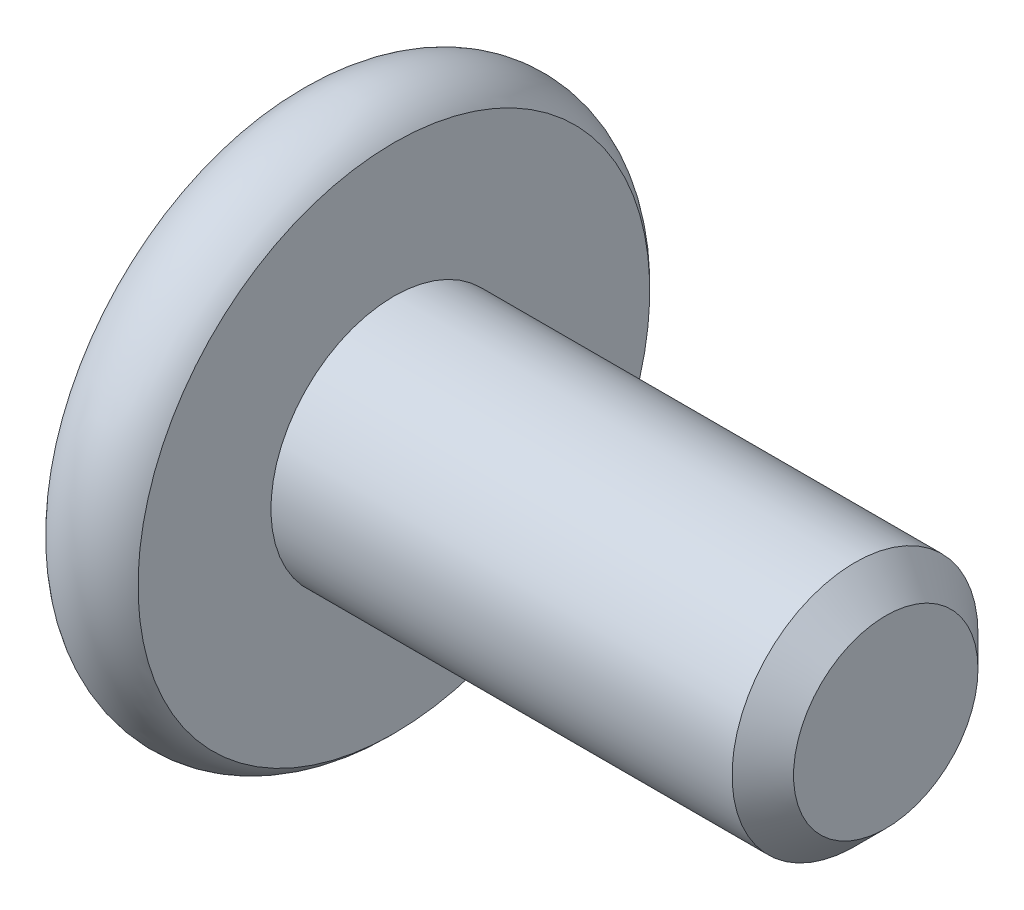
ISO-10303-21;
HEADER;
FILE_DESCRIPTION(('STEP AP214'),'2;1');
FILE_NAME('part.step','',(''),(''),'','','');
FILE_SCHEMA(('AUTOMOTIVE_DESIGN { 1 0 10303 214 1 1 1 1 }'));
ENDSEC;
DATA;
#1=APPLICATION_CONTEXT('core data for automotive mechanical design processes');
#2=APPLICATION_PROTOCOL_DEFINITION('international standard','automotive_design',2000,#1);
#3=PRODUCT_CONTEXT('',#1,'mechanical');
#4=PRODUCT('Part','Part','',(#3));
#5=PRODUCT_RELATED_PRODUCT_CATEGORY('part','',(#4));
#6=PRODUCT_DEFINITION_FORMATION('','',#4);
#7=PRODUCT_DEFINITION_CONTEXT('part definition',#1,'design');
#8=PRODUCT_DEFINITION('design','',#6,#7);
#9=PRODUCT_DEFINITION_SHAPE('','',#8);
#10=(LENGTH_UNIT() NAMED_UNIT(*) SI_UNIT(.MILLI.,.METRE.));
#11=(NAMED_UNIT(*) PLANE_ANGLE_UNIT() SI_UNIT($,.RADIAN.));
#12=(NAMED_UNIT(*) SI_UNIT($,.STERADIAN.) SOLID_ANGLE_UNIT());
#13=UNCERTAINTY_MEASURE_WITH_UNIT(LENGTH_MEASURE(1.E-05),#10,'distance_accuracy_value','');
#14=(GEOMETRIC_REPRESENTATION_CONTEXT(3) GLOBAL_UNCERTAINTY_ASSIGNED_CONTEXT((#13)) GLOBAL_UNIT_ASSIGNED_CONTEXT((#10,
#11,#12)) REPRESENTATION_CONTEXT('',''));
#15=CARTESIAN_POINT('',(0.,0.,0.));
#16=DIRECTION('',(0.,0.,1.));
#17=DIRECTION('',(1.,0.,0.));
#18=AXIS2_PLACEMENT_3D('',#15,#16,#17);
#19=CARTESIAN_POINT('',(-8.,0.,0.));
#20=DIRECTION('',(1.,0.,0.));
#21=DIRECTION('',(0.,0.,-1.));
#22=AXIS2_PLACEMENT_3D('',#19,#20,#21);
#23=CYLINDRICAL_SURFACE('',#22,2.);
#24=CARTESIAN_POINT('',(-0.500000000000002,0.,0.));
#25=DIRECTION('',(1.,0.,0.));
#26=DIRECTION('',(0.,0.,-1.));
#27=AXIS2_PLACEMENT_3D('',#24,#25,#26);
#28=CIRCLE('',#27,2.);
#29=CARTESIAN_POINT('',(-0.500000000000002,0.,-2.));
#30=VERTEX_POINT('',#29);
#31=EDGE_CURVE('E49',#30,#30,#28,.F.);
#32=ORIENTED_EDGE('',*,*,#31,.T.);
#33=EDGE_LOOP('',(#32));
#34=FACE_BOUND('',#33,.T.);
#35=CARTESIAN_POINT('',(-8.,0.,0.));
#36=DIRECTION('',(1.,0.,0.));
#37=DIRECTION('',(0.,1.,0.));
#38=AXIS2_PLACEMENT_3D('',#35,#36,#37);
#39=CIRCLE('',#38,2.);
#40=CARTESIAN_POINT('',(-8.,1.99999999999999,0.));
#41=VERTEX_POINT('',#40);
#42=EDGE_CURVE('E134',#41,#41,#39,.F.);
#43=ORIENTED_EDGE('',*,*,#42,.F.);
#44=EDGE_LOOP('',(#43));
#45=FACE_BOUND('',#44,.T.);
#46=ADVANCED_FACE('F35',(#34,#45),#23,.T.);
#47=CARTESIAN_POINT('',(0.,0.,0.));
#48=DIRECTION('',(1.,0.,0.));
#49=DIRECTION('',(0.,0.,-1.));
#50=AXIS2_PLACEMENT_3D('',#47,#48,#49);
#51=PLANE('',#50);
#52=CARTESIAN_POINT('',(0.,0.,0.));
#53=DIRECTION('',(1.,0.,0.));
#54=DIRECTION('',(0.,0.,-1.));
#55=AXIS2_PLACEMENT_3D('',#52,#53,#54);
#56=CIRCLE('',#55,1.5);
#57=CARTESIAN_POINT('',(0.,0.,-1.5));
#58=VERTEX_POINT('',#57);
#59=EDGE_CURVE('E138',#58,#58,#56,.T.);
#60=ORIENTED_EDGE('',*,*,#59,.T.);
#61=EDGE_LOOP('',(#60));
#62=FACE_BOUND('',#61,.T.);
#63=ADVANCED_FACE('F152',(#62),#51,.T.);
#64=CARTESIAN_POINT('',(0.,0.,0.));
#65=DIRECTION('',(-1.,0.,0.));
#66=DIRECTION('',(0.,0.,1.));
#67=AXIS2_PLACEMENT_3D('',#64,#65,#66);
#68=CONICAL_SURFACE('',#67,1.5,0.785398163397445);
#69=ORIENTED_EDGE('',*,*,#31,.F.);
#70=EDGE_LOOP('',(#69));
#71=FACE_BOUND('',#70,.T.);
#72=ORIENTED_EDGE('',*,*,#59,.F.);
#73=EDGE_LOOP('',(#72));
#74=FACE_BOUND('',#73,.T.);
#75=ADVANCED_FACE('F37',(#71,#74),#68,.T.);
#76=CARTESIAN_POINT('',(-9.5,0.,0.));
#77=DIRECTION('',(-1.,0.,0.));
#78=DIRECTION('',(0.,-1.,0.));
#79=AXIS2_PLACEMENT_3D('',#76,#77,#78);
#80=PLANE('',#79);
#81=CARTESIAN_POINT('',(-9.5,0.,0.));
#82=DIRECTION('',(-1.,0.,0.));
#83=DIRECTION('',(0.,-1.,0.));
#84=AXIS2_PLACEMENT_3D('',#81,#82,#83);
#85=CIRCLE('',#84,1.78205080756887);
#86=CARTESIAN_POINT('',(-9.50000000000001,-1.78205080756883,0.));
#87=VERTEX_POINT('',#86);
#88=EDGE_CURVE('E376',#87,#87,#85,.T.);
#89=ORIENTED_EDGE('',*,*,#88,.F.);
#90=EDGE_LOOP('',(#89));
#91=FACE_BOUND('',#90,.T.);
#92=CARTESIAN_POINT('',(-9.5,0.,0.));
#93=DIRECTION('',(1.,0.,0.));
#94=DIRECTION('',(0.,1.,0.));
#95=AXIS2_PLACEMENT_3D('',#92,#93,#94);
#96=CIRCLE('',#95,4.16143782776615);
#97=CARTESIAN_POINT('',(-9.5,4.16143782776615,0.));
#98=VERTEX_POINT('',#97);
#99=EDGE_CURVE('E130',#98,#98,#96,.T.);
#100=ORIENTED_EDGE('',*,*,#99,.F.);
#101=EDGE_LOOP('',(#100));
#102=FACE_BOUND('',#101,.T.);
#103=ADVANCED_FACE('F151',(#91,#102),#80,.T.);
#104=CARTESIAN_POINT('',(-8.75,0.,0.));
#105=DIRECTION('',(1.,0.,0.));
#106=DIRECTION('',(0.,1.,0.));
#107=AXIS2_PLACEMENT_3D('',#104,#105,#106);
#108=TOROIDAL_SURFACE('',#107,3.5,1.);
#109=ORIENTED_EDGE('',*,*,#99,.T.);
#110=EDGE_LOOP('',(#109));
#111=FACE_BOUND('',#110,.T.);
#112=CARTESIAN_POINT('',(-8.,0.,0.));
#113=DIRECTION('',(1.,0.,0.));
#114=DIRECTION('',(0.,1.,0.));
#115=AXIS2_PLACEMENT_3D('',#112,#113,#114);
#116=CIRCLE('',#115,4.16143782776615);
#117=CARTESIAN_POINT('',(-8.,4.16143782776615,0.));
#118=VERTEX_POINT('',#117);
#119=EDGE_CURVE('E126',#118,#118,#116,.T.);
#120=ORIENTED_EDGE('',*,*,#119,.F.);
#121=EDGE_LOOP('',(#120));
#122=FACE_BOUND('',#121,.T.);
#123=ADVANCED_FACE('F163',(#111,#122),#108,.T.);
#124=CARTESIAN_POINT('',(-8.,4.16143782776615,0.));
#125=DIRECTION('',(1.,0.,0.));
#126=DIRECTION('',(0.,1.,0.));
#127=AXIS2_PLACEMENT_3D('',#124,#125,#126);
#128=PLANE('',#127);
#129=ORIENTED_EDGE('',*,*,#42,.T.);
#130=EDGE_LOOP('',(#129));
#131=FACE_BOUND('',#130,.T.);
#132=ORIENTED_EDGE('',*,*,#119,.T.);
#133=EDGE_LOOP('',(#132));
#134=FACE_BOUND('',#133,.T.);
#135=ADVANCED_FACE('F167',(#131,#134),#128,.T.);
#136=CARTESIAN_POINT('',(-9.5,0.,0.));
#137=DIRECTION('',(-1.,0.,0.));
#138=DIRECTION('',(0.,-1.,0.));
#139=AXIS2_PLACEMENT_3D('',#136,#137,#138);
#140=CONICAL_SURFACE('',#139,1.78205080756887,0.78539816339745);
#141=ORIENTED_EDGE('',*,*,#88,.T.);
#142=EDGE_LOOP('',(#141));
#143=FACE_BOUND('',#142,.T.);
#144=CARTESIAN_POINT('',(-10.015428085613,-1.74023253176578,1.5));
#145=CARTESIAN_POINT('',(-9.98338110734452,-1.69791724929732,1.5));
#146=CARTESIAN_POINT('',(-9.95164446728407,-1.65536760966793,1.5));
#147=CARTESIAN_POINT('',(-9.8889203936153,-1.56970398156686,1.5));
#148=CARTESIAN_POINT('',(-9.85793314821998,-1.5265898554285,1.5));
#149=CARTESIAN_POINT('',(-9.76584616434498,-1.39562626326564,1.5));
#150=CARTESIAN_POINT('',(-9.70611451230213,-1.30679868010577,1.5));
#151=CARTESIAN_POINT('',(-9.58873428910124,-1.12044622640216,1.5));
#152=CARTESIAN_POINT('',(-9.53140827748225,-1.02271587306674,1.5));
#153=CARTESIAN_POINT('',(-9.42646321497596,-0.822357214965266,1.5));
#154=CARTESIAN_POINT('',(-9.37881142368962,-0.719746931701929,1.5));
#155=CARTESIAN_POINT('',(-9.32050998831504,-0.565852387095102,1.5));
#156=CARTESIAN_POINT('',(-9.30379905354091,-0.51687419142469,1.5));
#157=CARTESIAN_POINT('',(-9.2743077515089,-0.417723988457529,1.5));
#158=CARTESIAN_POINT('',(-9.26152765142192,-0.367551900263895,1.5));
#159=CARTESIAN_POINT('',(-9.24077842024577,-0.267158299056145,1.5));
#160=CARTESIAN_POINT('',(-9.23272606182594,-0.216954261864881,1.5));
#161=CARTESIAN_POINT('',(-9.22159163683403,-0.115994915871347,1.5));
#162=CARTESIAN_POINT('',(-9.21850868863769,-0.0652397064615641,1.5));
#163=CARTESIAN_POINT('',(-9.21754738974038,0.0344222234875319,1.5));
#164=CARTESIAN_POINT('',(-9.21947892169515,0.0833271701100658,1.5));
#165=CARTESIAN_POINT('',(-9.22801757296766,0.180724293127199,1.5));
#166=CARTESIAN_POINT('',(-9.23462514204803,0.229216429361706,1.5));
#167=CARTESIAN_POINT('',(-9.25226506264469,0.326258027696986,1.5));
#168=CARTESIAN_POINT('',(-9.26337316820097,0.374793507450007,1.5));
#169=CARTESIAN_POINT('',(-9.28941986695952,0.470802295834161,1.5));
#170=CARTESIAN_POINT('',(-9.3043581560035,0.518275688481264,1.5));
#171=CARTESIAN_POINT('',(-9.35683954571596,0.667150562065113,1.5));
#172=CARTESIAN_POINT('',(-9.40033511654417,0.766448362426832,1.5));
#173=CARTESIAN_POINT('',(-9.49705878148361,0.960384405673818,1.5));
#174=CARTESIAN_POINT('',(-9.55032172266746,1.05500437383619,1.5));
#175=CARTESIAN_POINT('',(-9.66022580104534,1.2358452032153,1.5));
#176=CARTESIAN_POINT('',(-9.7165682531046,1.32224986946548,1.5));
#177=CARTESIAN_POINT('',(-9.80367557259701,1.44954953726472,1.5));
#178=CARTESIAN_POINT('',(-9.83301999068387,1.49143368482421,1.5));
#179=CARTESIAN_POINT('',(-9.89248691829305,1.57462914783243,1.5));
#180=CARTESIAN_POINT('',(-9.92260921150072,1.61594061772578,1.5));
#181=CARTESIAN_POINT('',(-9.95305411813655,1.65701358742551,1.5));
#182=B_SPLINE_CURVE_WITH_KNOTS('',3,(#144,#145,#146,#147,#148,#149,#150,#151,#152,#153,#154,
#155,#156,#157,#158,#159,#160,#161,#162,#163,#164,#165,#166,#167,#168,#169,#170,#171,#172,#173,
#174,#175,#176,#177,#178,#179,#180,#181),.UNSPECIFIED.,.F.,.F.,(4,2,2,2,2,2,2,2,2,2,2,2,2,2,2,2,
2,2,4),(0.,0.159238974218354,0.318517535014543,0.639504781932389,0.9791378937992,
1.31760168934357,1.47272233841624,1.62785352839776,1.78016486537347,1.93244917778279,
2.07904486260298,2.22565464958333,2.37484213303399,2.5240177730404,2.84828365283776,
3.1737297566675,3.48303030530537,3.63644667013909,3.78982082222913),.UNSPECIFIED.);
#183=CARTESIAN_POINT('',(-9.45000000000002,-0.866025403784403,1.5));
#184=VERTEX_POINT('',#183);
#185=CARTESIAN_POINT('',(-9.45000000000001,0.866025403784475,1.5));
#186=VERTEX_POINT('',#185);
#187=EDGE_CURVE('E104',#184,#186,#182,.T.);
#188=ORIENTED_EDGE('',*,*,#187,.F.);
#189=CARTESIAN_POINT('',(-9.45011548160009,-1.73216627762268,-0.0002000000000008));
#190=CARTESIAN_POINT('',(-9.42036547606735,-1.70239359975911,0.0513677907370748));
#191=CARTESIAN_POINT('',(-9.39236248391033,-1.67212305186351,0.1037979176652));
#192=CARTESIAN_POINT('',(-9.34108923044016,-1.61039789003616,0.210709034055596));
#193=CARTESIAN_POINT('',(-9.31784750504439,-1.57893740312611,0.265200195814661));
#194=CARTESIAN_POINT('',(-9.27803372899224,-1.51549879897984,0.375079081357248));
#195=CARTESIAN_POINT('',(-9.26136158567092,-1.48353684526807,0.430438809095199));
#196=CARTESIAN_POINT('',(-9.23567445681812,-1.41890915196208,0.54237725747715));
#197=CARTESIAN_POINT('',(-9.22664029047888,-1.38624538781115,0.598952556553008));
#198=CARTESIAN_POINT('',(-9.21848908122687,-1.32995210095296,0.696455389516441));
#199=CARTESIAN_POINT('',(-9.21728225298923,-1.3063953331112,0.737256908280466));
#200=CARTESIAN_POINT('',(-9.21931405716228,-1.2593233529019,0.818787969615858));
#201=CARTESIAN_POINT('',(-9.22255367074832,-1.2358081508531,0.85951749431463));
#202=CARTESIAN_POINT('',(-9.23329198598198,-1.18900414978423,0.940584402163416));
#203=CARTESIAN_POINT('',(-9.24079465301875,-1.16571558211716,0.980921384598288));
#204=CARTESIAN_POINT('',(-9.25965161192831,-1.11952932016332,1.06091833691403));
#205=CARTESIAN_POINT('',(-9.2710075570186,-1.09663179808783,1.10057800851621));
#206=CARTESIAN_POINT('',(-9.30472164759269,-1.03798159809695,1.20216313477448));
#207=CARTESIAN_POINT('',(-9.32962184909338,-1.00259267147462,1.26345855370969));
#208=CARTESIAN_POINT('',(-9.37165665327159,-0.950557780604339,1.35358562846331));
#209=CARTESIAN_POINT('',(-9.38642515355911,-0.933410759677112,1.38328513990772));
#210=CARTESIAN_POINT('',(-9.41731056594019,-0.899432101996371,1.44213790138375));
#211=CARTESIAN_POINT('',(-9.43342683412173,-0.882600319285675,1.47129140422064));
#212=CARTESIAN_POINT('',(-9.45011548160009,-0.865909933730565,1.5002));
#213=B_SPLINE_CURVE_WITH_KNOTS('',3,(#189,#190,#191,#192,#193,#194,#195,#196,#197,#198,#199,
#200,#201,#202,#203,#204,#205,#206,#207,#208,#209,#210,#211,#212),.UNSPECIFIED.,.F.,.F.,(4,2,2,
2,2,2,2,2,2,2,2,4),(0.,0.199829143693305,0.400822987382389,0.598623720538181,0.795926240188889,
0.937113067959881,1.07833105577193,1.21968061668222,1.36109089931054,1.58570969637565,
1.69770705470964,1.80965120737194),.UNSPECIFIED.);
#214=CARTESIAN_POINT('',(-9.45000000000002,-1.73205080756884,0.));
#215=VERTEX_POINT('',#214);
#216=EDGE_CURVE('E209',#215,#184,#213,.T.);
#217=ORIENTED_EDGE('',*,*,#216,.F.);
#218=CARTESIAN_POINT('',(-9.45011548160009,-0.865909933730564,-1.5002));
#219=CARTESIAN_POINT('',(-9.42036547606734,-0.895682611594129,-1.44863220926292));
#220=CARTESIAN_POINT('',(-9.39236248391033,-0.925953159489729,-1.3962020823348));
#221=CARTESIAN_POINT('',(-9.34108923044016,-0.987678321317088,-1.2892909659444));
#222=CARTESIAN_POINT('',(-9.31784750504439,-1.01913880822714,-1.23479980418534));
#223=CARTESIAN_POINT('',(-9.27803372899224,-1.08257741237341,-1.12492091864275));
#224=CARTESIAN_POINT('',(-9.26136158567091,-1.11453936608518,-1.0695611909048));
#225=CARTESIAN_POINT('',(-9.23567445681812,-1.17916705939117,-0.95762274252285));
#226=CARTESIAN_POINT('',(-9.22664029047888,-1.2118308235421,-0.901047443446992));
#227=CARTESIAN_POINT('',(-9.21848908122687,-1.26812411040029,-0.80354461048356));
#228=CARTESIAN_POINT('',(-9.21728225298923,-1.29168087824204,-0.762743091719535));
#229=CARTESIAN_POINT('',(-9.21931405716228,-1.33875285845135,-0.681212030384143));
#230=CARTESIAN_POINT('',(-9.22255367074832,-1.36226806050015,-0.640482505685371));
#231=CARTESIAN_POINT('',(-9.23329198598198,-1.40907206156901,-0.559415597836585));
#232=CARTESIAN_POINT('',(-9.24079465301875,-1.43236062923608,-0.519078615401713));
#233=CARTESIAN_POINT('',(-9.25965161192831,-1.47854689118993,-0.43908166308597));
#234=CARTESIAN_POINT('',(-9.2710075570186,-1.50144441326542,-0.399421991483793));
#235=CARTESIAN_POINT('',(-9.30472164759269,-1.5600946132563,-0.297836865225517));
#236=CARTESIAN_POINT('',(-9.32962184909339,-1.59548353987863,-0.236541446290313));
#237=CARTESIAN_POINT('',(-9.37165665327159,-1.6475184307489,-0.146414371536688));
#238=CARTESIAN_POINT('',(-9.38642515355911,-1.66466545167613,-0.116714860092284));
#239=CARTESIAN_POINT('',(-9.41731056594019,-1.69864410935687,-0.0578620986162505));
#240=CARTESIAN_POINT('',(-9.43342683412173,-1.71547589206757,-0.0287085957793642));
#241=CARTESIAN_POINT('',(-9.45011548160009,-1.73216627762268,0.000199999999998753));
#242=B_SPLINE_CURVE_WITH_KNOTS('',3,(#218,#219,#220,#221,#222,#223,#224,#225,#226,#227,#228,
#229,#230,#231,#232,#233,#234,#235,#236,#237,#238,#239,#240,#241),.UNSPECIFIED.,.F.,.F.,(4,2,2,
2,2,2,2,2,2,2,2,4),(0.,0.199829143693305,0.400822987382389,0.59862372053818,0.795926240188888,
0.93711306795988,1.07833105577193,1.21968061668222,1.36109089931054,1.58570969637565,
1.69770705470963,1.80965120737194),.UNSPECIFIED.);
#243=CARTESIAN_POINT('',(-9.45000000000002,-0.866025403784402,-1.5));
#244=VERTEX_POINT('',#243);
#245=EDGE_CURVE('E204',#244,#215,#242,.T.);
#246=ORIENTED_EDGE('',*,*,#245,.F.);
#247=CARTESIAN_POINT('',(-10.0154280857208,-1.74023253190811,-1.5));
#248=CARTESIAN_POINT('',(-9.98338110744817,-1.69791724943563,-1.5));
#249=CARTESIAN_POINT('',(-9.95164446738357,-1.65536760980222,-1.5));
#250=CARTESIAN_POINT('',(-9.88892039370652,-1.56970398169306,-1.5));
#251=CARTESIAN_POINT('',(-9.85793314830708,-1.52658985555063,-1.5));
#252=CARTESIAN_POINT('',(-9.76584616441963,-1.39562626337533,-1.5));
#253=CARTESIAN_POINT('',(-9.70611451236851,-1.30679868020699,-1.5));
#254=CARTESIAN_POINT('',(-9.58873428915059,-1.12044622648493,-1.5));
#255=CARTESIAN_POINT('',(-9.53140827752292,-1.02271587313946,-1.5));
#256=CARTESIAN_POINT('',(-9.42646321500052,-0.822357215017053,-1.5));
#257=CARTESIAN_POINT('',(-9.37881142370675,-0.719746931742828,-1.5));
#258=CARTESIAN_POINT('',(-9.32050998832669,-0.565852387127819,-1.5));
#259=CARTESIAN_POINT('',(-9.30379905355281,-0.516874191460854,-1.5));
#260=CARTESIAN_POINT('',(-9.2743077515206,-0.417723988500702,-1.5));
#261=CARTESIAN_POINT('',(-9.26152765143317,-0.367551900310631,-1.5));
#262=CARTESIAN_POINT('',(-9.24077842025532,-0.267158299109891,-1.5));
#263=CARTESIAN_POINT('',(-9.23272606183424,-0.216954261922072,-1.5));
#264=CARTESIAN_POINT('',(-9.22159163683908,-0.115994915935317,-1.5));
#265=CARTESIAN_POINT('',(-9.21850868864073,-0.0652397065288679,-1.5));
#266=CARTESIAN_POINT('',(-9.21754738973879,0.0344222234141592,-1.5));
#267=CARTESIAN_POINT('',(-9.21947892169101,0.0833271700339495,-1.5));
#268=CARTESIAN_POINT('',(-9.22801757295801,0.180724293045874,-1.5));
#269=CARTESIAN_POINT('',(-9.23462514203542,0.229216429277917,-1.5));
#270=CARTESIAN_POINT('',(-9.2522650626259,0.326258027608332,-1.5));
#271=CARTESIAN_POINT('',(-9.26337316817893,0.37479350735896,-1.5));
#272=CARTESIAN_POINT('',(-9.28941986693092,0.470802295738563,-1.5));
#273=CARTESIAN_POINT('',(-9.30435815597158,0.518275688383507,-1.5));
#274=CARTESIAN_POINT('',(-9.35683954566847,0.66715056194616,-1.5));
#275=CARTESIAN_POINT('',(-9.40033511648235,0.766448362289903,-1.5));
#276=CARTESIAN_POINT('',(-9.49705878139157,0.960384405502318,-1.5));
#277=CARTESIAN_POINT('',(-9.5503217225595,1.0550043736481,-1.5));
#278=CARTESIAN_POINT('',(-9.66022580090691,1.2358452029974,-1.5));
#279=CARTESIAN_POINT('',(-9.71656825295176,1.32224986923425,-1.5));
#280=CARTESIAN_POINT('',(-9.80367557242264,1.44954953701377,-1.5));
#281=CARTESIAN_POINT('',(-9.83301999050238,1.49143368456679,-1.5));
#282=CARTESIAN_POINT('',(-9.89248691809732,1.57462914756209,-1.5));
#283=CARTESIAN_POINT('',(-9.92260921129788,1.615940617449,-1.5));
#284=CARTESIAN_POINT('',(-9.9530541179266,1.65701358714232,-1.5));
#285=B_SPLINE_CURVE_WITH_KNOTS('',3,(#247,#248,#249,#250,#251,#252,#253,#254,#255,#256,#257,
#258,#259,#260,#261,#262,#263,#264,#265,#266,#267,#268,#269,#270,#271,#272,#273,#274,#275,#276,
#277,#278,#279,#280,#281,#282,#283,#284),.UNSPECIFIED.,.F.,.F.,(4,2,2,2,2,2,2,2,2,2,2,2,2,2,2,2,
2,2,4),(0.,0.159238974235479,0.318517535048799,0.639504782001543,0.979137893907513,
1.31760168949067,1.47272233855335,1.62785352852489,1.78016486549104,1.93244917789081,
2.0790448627025,2.22565464967435,2.37484213311585,2.52401777311309,2.8482836528441,
3.17372975660706,3.48303030518781,3.63644666999335,3.78982082205522),.UNSPECIFIED.);
#286=CARTESIAN_POINT('',(-9.45000000000001,0.866025403784475,-1.5));
#287=VERTEX_POINT('',#286);
#288=EDGE_CURVE('E56',#287,#244,#285,.F.);
#289=ORIENTED_EDGE('',*,*,#288,.F.);
#290=CARTESIAN_POINT('',(-9.45011548160008,1.73216627762275,0.000200000000000434));
#291=CARTESIAN_POINT('',(-9.42036547606733,1.70239359975919,-0.0513677907370751));
#292=CARTESIAN_POINT('',(-9.39236248391032,1.67212305186359,-0.1037979176652));
#293=CARTESIAN_POINT('',(-9.34108923044015,1.61039789003623,-0.210709034055596));
#294=CARTESIAN_POINT('',(-9.31784750504438,1.57893740312618,-0.265200195814661));
#295=CARTESIAN_POINT('',(-9.27803372899223,1.51549879897991,-0.375079081357249));
#296=CARTESIAN_POINT('',(-9.2613615856709,1.48353684526814,-0.4304388090952));
#297=CARTESIAN_POINT('',(-9.23567445681811,1.41890915196215,-0.542377257477151));
#298=CARTESIAN_POINT('',(-9.22664029047887,1.38624538781122,-0.598952556553009));
#299=CARTESIAN_POINT('',(-9.21848908122686,1.32995210095303,-0.696455389516441));
#300=CARTESIAN_POINT('',(-9.21728225298922,1.30639533311127,-0.737256908280467));
#301=CARTESIAN_POINT('',(-9.21931405716228,1.25932335290197,-0.818787969615859));
#302=CARTESIAN_POINT('',(-9.22255367074832,1.23580815085317,-0.859517494314631));
#303=CARTESIAN_POINT('',(-9.23329198598197,1.1890041497843,-0.940584402163417));
#304=CARTESIAN_POINT('',(-9.24079465301874,1.16571558211723,-0.980921384598289));
#305=CARTESIAN_POINT('',(-9.2596516119283,1.11952932016339,-1.06091833691403));
#306=CARTESIAN_POINT('',(-9.27100755701859,1.0966317980879,-1.10057800851621));
#307=CARTESIAN_POINT('',(-9.30472164759268,1.03798159809702,-1.20216313477449));
#308=CARTESIAN_POINT('',(-9.32962184909338,1.00259267147469,-1.26345855370969));
#309=CARTESIAN_POINT('',(-9.37165665327159,0.950557780604411,-1.35358562846331));
#310=CARTESIAN_POINT('',(-9.38642515355911,0.933410759677184,-1.38328513990772));
#311=CARTESIAN_POINT('',(-9.41731056594018,0.899432101996443,-1.44213790138375));
#312=CARTESIAN_POINT('',(-9.43342683412172,0.882600319285746,-1.47129140422064));
#313=CARTESIAN_POINT('',(-9.45011548160008,0.865909933730638,-1.5002));
#314=B_SPLINE_CURVE_WITH_KNOTS('',3,(#290,#291,#292,#293,#294,#295,#296,#297,#298,#299,#300,
#301,#302,#303,#304,#305,#306,#307,#308,#309,#310,#311,#312,#313),.UNSPECIFIED.,.F.,.F.,(4,2,2,
2,2,2,2,2,2,2,2,4),(0.,0.199829143693305,0.40082298738239,0.598623720538181,0.79592624018889,
0.937113067959882,1.07833105577193,1.21968061668222,1.36109089931055,1.58570969637565,
1.69770705470964,1.80965120737194),.UNSPECIFIED.);
#315=CARTESIAN_POINT('',(-9.45000000000001,1.73205080756891,0.));
#316=VERTEX_POINT('',#315);
#317=EDGE_CURVE('E11',#316,#287,#314,.T.);
#318=ORIENTED_EDGE('',*,*,#317,.F.);
#319=CARTESIAN_POINT('',(-9.45011548160008,0.865909933730637,1.5002));
#320=CARTESIAN_POINT('',(-9.42036547606734,0.895682611594202,1.44863220926292));
#321=CARTESIAN_POINT('',(-9.39236248391032,0.925953159489801,1.3962020823348));
#322=CARTESIAN_POINT('',(-9.34108923044015,0.987678321317159,1.2892909659444));
#323=CARTESIAN_POINT('',(-9.31784750504438,1.01913880822721,1.23479980418534));
#324=CARTESIAN_POINT('',(-9.27803372899223,1.08257741237348,1.12492091864275));
#325=CARTESIAN_POINT('',(-9.2613615856709,1.11453936608525,1.0695611909048));
#326=CARTESIAN_POINT('',(-9.23567445681811,1.17916705939124,0.95762274252285));
#327=CARTESIAN_POINT('',(-9.22664029047887,1.21183082354217,0.901047443446993));
#328=CARTESIAN_POINT('',(-9.21848908122686,1.26812411040036,0.803544610483561));
#329=CARTESIAN_POINT('',(-9.21728225298922,1.29168087824211,0.762743091719535));
#330=CARTESIAN_POINT('',(-9.21931405716227,1.33875285845142,0.681212030384143));
#331=CARTESIAN_POINT('',(-9.22255367074831,1.36226806050022,0.640482505685372));
#332=CARTESIAN_POINT('',(-9.23329198598197,1.40907206156908,0.559415597836586));
#333=CARTESIAN_POINT('',(-9.24079465301874,1.43236062923616,0.519078615401714));
#334=CARTESIAN_POINT('',(-9.2596516119283,1.47854689119,0.439081663085971));
#335=CARTESIAN_POINT('',(-9.27100755701859,1.50144441326549,0.399421991483793));
#336=CARTESIAN_POINT('',(-9.30472164759268,1.56009461325637,0.297836865225516));
#337=CARTESIAN_POINT('',(-9.32962184909337,1.5954835398787,0.236541446290312));
#338=CARTESIAN_POINT('',(-9.37165665327158,1.64751843074898,0.146414371536687));
#339=CARTESIAN_POINT('',(-9.3864251535591,1.6646654516762,0.116714860092283));
#340=CARTESIAN_POINT('',(-9.41731056594018,1.69864410935694,0.0578620986162494));
#341=CARTESIAN_POINT('',(-9.43342683412172,1.71547589206764,0.0287085957793633));
#342=CARTESIAN_POINT('',(-9.45011548160008,1.73216627762275,-0.000199999999999442));
#343=B_SPLINE_CURVE_WITH_KNOTS('',3,(#319,#320,#321,#322,#323,#324,#325,#326,#327,#328,#329,
#330,#331,#332,#333,#334,#335,#336,#337,#338,#339,#340,#341,#342),.UNSPECIFIED.,.F.,.F.,(4,2,2,
2,2,2,2,2,2,2,2,4),(0.,0.199829143693304,0.400822987382387,0.598623720538179,0.795926240188887,
0.937113067959879,1.07833105577193,1.21968061668222,1.36109089931054,1.58570969637565,
1.69770705470963,1.80965120737194),.UNSPECIFIED.);
#344=EDGE_CURVE('E94',#186,#316,#343,.T.);
#345=ORIENTED_EDGE('',*,*,#344,.F.);
#346=EDGE_LOOP('',(#188,#217,#246,#289,#318,#345));
#347=FACE_BOUND('',#346,.T.);
#348=ADVANCED_FACE('F93',(#143,#347),#140,.F.);
#349=CARTESIAN_POINT('',(-7.2,0.,0.));
#350=DIRECTION('',(-1.,0.,0.));
#351=DIRECTION('',(0.,-1.,0.));
#352=AXIS2_PLACEMENT_3D('',#349,#350,#351);
#353=PLANE('',#352);
#354=DIRECTION('',(0.,0.5,-0.866025403784438));
#355=VECTOR('',#354,1.);
#356=CARTESIAN_POINT('',(-7.2,0.866025403784467,1.5));
#357=LINE('',#356,#355);
#358=CARTESIAN_POINT('',(-7.2,0.866025403784467,1.5));
#359=VERTEX_POINT('',#358);
#360=CARTESIAN_POINT('',(-7.19999999999999,1.7320508075689,0.));
#361=VERTEX_POINT('',#360);
#362=EDGE_CURVE('E103',#359,#361,#357,.T.);
#363=ORIENTED_EDGE('',*,*,#362,.T.);
#364=DIRECTION('',(0.,-0.5,-0.866025403784439));
#365=VECTOR('',#364,1.);
#366=CARTESIAN_POINT('',(-7.19999999999999,1.7320508075689,0.));
#367=LINE('',#366,#365);
#368=CARTESIAN_POINT('',(-7.2,0.866025403784467,-1.5));
#369=VERTEX_POINT('',#368);
#370=EDGE_CURVE('E108',#361,#369,#367,.T.);
#371=ORIENTED_EDGE('',*,*,#370,.T.);
#372=DIRECTION('',(0.,-1.,0.));
#373=VECTOR('',#372,1.);
#374=CARTESIAN_POINT('',(-7.2,0.866025403784467,-1.5));
#375=LINE('',#374,#373);
#376=CARTESIAN_POINT('',(-7.2,-0.866025403784411,-1.5));
#377=VERTEX_POINT('',#376);
#378=EDGE_CURVE('E235',#369,#377,#375,.T.);
#379=ORIENTED_EDGE('',*,*,#378,.T.);
#380=DIRECTION('',(0.,-0.5,0.866025403784439));
#381=VECTOR('',#380,1.);
#382=CARTESIAN_POINT('',(-7.2,-0.866025403784411,-1.5));
#383=LINE('',#382,#381);
#384=CARTESIAN_POINT('',(-7.20000000000001,-1.73205080756885,0.));
#385=VERTEX_POINT('',#384);
#386=EDGE_CURVE('E240',#377,#385,#383,.T.);
#387=ORIENTED_EDGE('',*,*,#386,.T.);
#388=DIRECTION('',(0.,0.5,0.866025403784439));
#389=VECTOR('',#388,1.);
#390=CARTESIAN_POINT('',(-7.20000000000001,-1.73205080756885,0.));
#391=LINE('',#390,#389);
#392=CARTESIAN_POINT('',(-7.2,-0.866025403784412,1.5));
#393=VERTEX_POINT('',#392);
#394=EDGE_CURVE('E122',#385,#393,#391,.T.);
#395=ORIENTED_EDGE('',*,*,#394,.T.);
#396=DIRECTION('',(0.,1.,0.));
#397=VECTOR('',#396,1.);
#398=CARTESIAN_POINT('',(-7.2,-0.866025403784412,1.5));
#399=LINE('',#398,#397);
#400=EDGE_CURVE('E112',#393,#359,#399,.T.);
#401=ORIENTED_EDGE('',*,*,#400,.T.);
#402=EDGE_LOOP('',(#363,#371,#379,#387,#395,#401));
#403=FACE_BOUND('',#402,.T.);
#404=ADVANCED_FACE('F191',(#403),#353,.T.);
#405=CARTESIAN_POINT('',(-7.19999999999999,1.7320508075689,0.));
#406=DIRECTION('',(0.,0.866025403784439,-0.5));
#407=DIRECTION('',(0.,0.5,0.866025403784439));
#408=AXIS2_PLACEMENT_3D('',#405,#406,#407);
#409=PLANE('',#408);
#410=DIRECTION('',(-1.,0.,0.));
#411=VECTOR('',#410,1.);
#412=CARTESIAN_POINT('',(-7.19999999999999,1.7320508075689,0.));
#413=LINE('',#412,#411);
#414=EDGE_CURVE('E100',#361,#316,#413,.T.);
#415=ORIENTED_EDGE('',*,*,#414,.T.);
#416=ORIENTED_EDGE('',*,*,#317,.T.);
#417=DIRECTION('',(-1.,0.,0.));
#418=VECTOR('',#417,1.);
#419=CARTESIAN_POINT('',(-7.2,0.866025403784467,-1.5));
#420=LINE('',#419,#418);
#421=EDGE_CURVE('E111',#369,#287,#420,.T.);
#422=ORIENTED_EDGE('',*,*,#421,.F.);
#423=ORIENTED_EDGE('',*,*,#370,.F.);
#424=EDGE_LOOP('',(#415,#416,#422,#423));
#425=FACE_BOUND('',#424,.T.);
#426=ADVANCED_FACE('F106',(#425),#409,.F.);
#427=CARTESIAN_POINT('',(-7.2,0.866025403784467,-1.5));
#428=DIRECTION('',(0.,0.,-1.));
#429=DIRECTION('',(0.,1.,0.));
#430=AXIS2_PLACEMENT_3D('',#427,#428,#429);
#431=PLANE('',#430);
#432=ORIENTED_EDGE('',*,*,#421,.T.);
#433=ORIENTED_EDGE('',*,*,#288,.T.);
#434=DIRECTION('',(-1.,0.,0.));
#435=VECTOR('',#434,1.);
#436=CARTESIAN_POINT('',(-7.2,-0.866025403784411,-1.5));
#437=LINE('',#436,#435);
#438=EDGE_CURVE('E118',#377,#244,#437,.T.);
#439=ORIENTED_EDGE('',*,*,#438,.F.);
#440=ORIENTED_EDGE('',*,*,#378,.F.);
#441=EDGE_LOOP('',(#432,#433,#439,#440));
#442=FACE_BOUND('',#441,.T.);
#443=ADVANCED_FACE('F224',(#442),#431,.F.);
#444=CARTESIAN_POINT('',(-7.2,-0.866025403784411,-1.5));
#445=DIRECTION('',(0.,-0.866025403784439,-0.5));
#446=DIRECTION('',(0.,0.5,-0.866025403784438));
#447=AXIS2_PLACEMENT_3D('',#444,#445,#446);
#448=PLANE('',#447);
#449=ORIENTED_EDGE('',*,*,#438,.T.);
#450=ORIENTED_EDGE('',*,*,#245,.T.);
#451=DIRECTION('',(-1.,0.,0.));
#452=VECTOR('',#451,1.);
#453=CARTESIAN_POINT('',(-7.20000000000001,-1.73205080756885,0.));
#454=LINE('',#453,#452);
#455=EDGE_CURVE('E256',#385,#215,#454,.T.);
#456=ORIENTED_EDGE('',*,*,#455,.F.);
#457=ORIENTED_EDGE('',*,*,#386,.F.);
#458=EDGE_LOOP('',(#449,#450,#456,#457));
#459=FACE_BOUND('',#458,.T.);
#460=ADVANCED_FACE('F219',(#459),#448,.F.);
#461=CARTESIAN_POINT('',(-7.20000000000001,-1.73205080756885,0.));
#462=DIRECTION('',(0.,-0.866025403784439,0.5));
#463=DIRECTION('',(0.,-0.5,-0.866025403784439));
#464=AXIS2_PLACEMENT_3D('',#461,#462,#463);
#465=PLANE('',#464);
#466=ORIENTED_EDGE('',*,*,#455,.T.);
#467=ORIENTED_EDGE('',*,*,#216,.T.);
#468=DIRECTION('',(-1.,0.,0.));
#469=VECTOR('',#468,1.);
#470=CARTESIAN_POINT('',(-7.2,-0.866025403784412,1.5));
#471=LINE('',#470,#469);
#472=EDGE_CURVE('E252',#393,#184,#471,.T.);
#473=ORIENTED_EDGE('',*,*,#472,.F.);
#474=ORIENTED_EDGE('',*,*,#394,.F.);
#475=EDGE_LOOP('',(#466,#467,#473,#474));
#476=FACE_BOUND('',#475,.T.);
#477=ADVANCED_FACE('F216',(#476),#465,.F.);
#478=CARTESIAN_POINT('',(-7.2,-0.866025403784412,1.5));
#479=DIRECTION('',(0.,0.,1.));
#480=DIRECTION('',(1.,0.,0.));
#481=AXIS2_PLACEMENT_3D('',#478,#479,#480);
#482=PLANE('',#481);
#483=ORIENTED_EDGE('',*,*,#472,.T.);
#484=ORIENTED_EDGE('',*,*,#187,.T.);
#485=DIRECTION('',(-1.,0.,0.));
#486=VECTOR('',#485,1.);
#487=CARTESIAN_POINT('',(-7.2,0.866025403784467,1.5));
#488=LINE('',#487,#486);
#489=EDGE_CURVE('E63',#359,#186,#488,.T.);
#490=ORIENTED_EDGE('',*,*,#489,.F.);
#491=ORIENTED_EDGE('',*,*,#400,.F.);
#492=EDGE_LOOP('',(#483,#484,#490,#491));
#493=FACE_BOUND('',#492,.T.);
#494=ADVANCED_FACE('F174',(#493),#482,.F.);
#495=CARTESIAN_POINT('',(-7.2,0.866025403784467,1.5));
#496=DIRECTION('',(0.,0.866025403784439,0.5));
#497=DIRECTION('',(0.,-0.5,0.866025403784439));
#498=AXIS2_PLACEMENT_3D('',#495,#496,#497);
#499=PLANE('',#498);
#500=ORIENTED_EDGE('',*,*,#489,.T.);
#501=ORIENTED_EDGE('',*,*,#344,.T.);
#502=ORIENTED_EDGE('',*,*,#414,.F.);
#503=ORIENTED_EDGE('',*,*,#362,.F.);
#504=EDGE_LOOP('',(#500,#501,#502,#503));
#505=FACE_BOUND('',#504,.T.);
#506=ADVANCED_FACE('F99',(#505),#499,.F.);
#507=CLOSED_SHELL('',(#46,#63,#75,#103,#123,#135,#348,#404,#426,#443,#460,#477,#494,#506));
#508=MANIFOLD_SOLID_BREP('B2',#507);
#509=ADVANCED_BREP_SHAPE_REPRESENTATION('',(#18,#508),#14);
#510=SHAPE_DEFINITION_REPRESENTATION(#9,#509);
ENDSEC;
END-ISO-10303-21;
